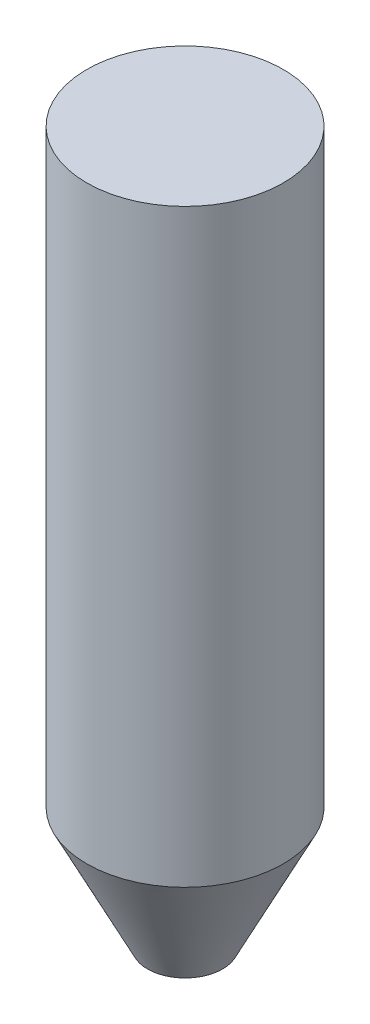
ISO-10303-21;
HEADER;
FILE_DESCRIPTION(('STEP AP214'),'2;1');
FILE_NAME('part.step','',(''),(''),'','','');
FILE_SCHEMA(('AUTOMOTIVE_DESIGN { 1 0 10303 214 1 1 1 1 }'));
ENDSEC;
DATA;
#1=APPLICATION_CONTEXT('core data for automotive mechanical design processes');
#2=APPLICATION_PROTOCOL_DEFINITION('international standard','automotive_design',2000,#1);
#3=PRODUCT_CONTEXT('',#1,'mechanical');
#4=PRODUCT('Part','Part','',(#3));
#5=PRODUCT_RELATED_PRODUCT_CATEGORY('part','',(#4));
#6=PRODUCT_DEFINITION_FORMATION('','',#4);
#7=PRODUCT_DEFINITION_CONTEXT('part definition',#1,'design');
#8=PRODUCT_DEFINITION('design','',#6,#7);
#9=PRODUCT_DEFINITION_SHAPE('','',#8);
#10=(LENGTH_UNIT() NAMED_UNIT(*) SI_UNIT(.MILLI.,.METRE.));
#11=(NAMED_UNIT(*) PLANE_ANGLE_UNIT() SI_UNIT($,.RADIAN.));
#12=(NAMED_UNIT(*) SI_UNIT($,.STERADIAN.) SOLID_ANGLE_UNIT());
#13=UNCERTAINTY_MEASURE_WITH_UNIT(LENGTH_MEASURE(1.E-05),#10,'distance_accuracy_value','');
#14=(GEOMETRIC_REPRESENTATION_CONTEXT(3) GLOBAL_UNCERTAINTY_ASSIGNED_CONTEXT((#13)) GLOBAL_UNIT_ASSIGNED_CONTEXT((#10,
#11,#12)) REPRESENTATION_CONTEXT('',''));
#15=CARTESIAN_POINT('',(0.,0.,0.));
#16=DIRECTION('',(0.,0.,1.));
#17=DIRECTION('',(1.,0.,0.));
#18=AXIS2_PLACEMENT_3D('',#15,#16,#17);
#19=CARTESIAN_POINT('',(0.,-12.0341960131261,0.));
#20=DIRECTION('',(0.,1.,0.));
#21=DIRECTION('',(0.,0.,1.));
#22=AXIS2_PLACEMENT_3D('',#19,#20,#21);
#23=CONICAL_SURFACE('',#22,0.,0.463647609000806);
#24=CARTESIAN_POINT('',(0.,26.0658039868739,0.));
#25=DIRECTION('',(0.,1.,0.));
#26=DIRECTION('',(0.,0.,1.));
#27=AXIS2_PLACEMENT_3D('',#24,#25,#26);
#28=CIRCLE('',#27,19.05);
#29=CARTESIAN_POINT('',(0.,26.0658039868739,19.05));
#30=VERTEX_POINT('',#29);
#31=EDGE_CURVE('E46',#30,#30,#28,.T.);
#32=ORIENTED_EDGE('',*,*,#31,.F.);
#33=EDGE_LOOP('',(#32));
#34=FACE_BOUND('',#33,.T.);
#35=CARTESIAN_POINT('',(0.,2.52338782459516,0.));
#36=DIRECTION('',(0.,1.,0.));
#37=DIRECTION('',(0.,0.,1.));
#38=AXIS2_PLACEMENT_3D('',#35,#36,#37);
#39=CIRCLE('',#38,7.27879191886063);
#40=CARTESIAN_POINT('',(0.,2.52338782459516,7.27879191886063));
#41=VERTEX_POINT('',#40);
#42=EDGE_CURVE('E10',#41,#41,#39,.T.);
#43=ORIENTED_EDGE('',*,*,#42,.T.);
#44=EDGE_LOOP('',(#43));
#45=FACE_BOUND('',#44,.T.);
#46=ADVANCED_FACE('F39',(#34,#45),#23,.T.);
#47=CARTESIAN_POINT('',(0.,140.365803986874,0.));
#48=DIRECTION('',(0.,-1.,0.));
#49=DIRECTION('',(0.,0.,-1.));
#50=AXIS2_PLACEMENT_3D('',#47,#48,#49);
#51=CYLINDRICAL_SURFACE('',#50,19.05);
#52=CARTESIAN_POINT('',(0.,140.365803986874,0.));
#53=DIRECTION('',(0.,1.,0.));
#54=DIRECTION('',(0.,0.,1.));
#55=AXIS2_PLACEMENT_3D('',#52,#53,#54);
#56=CIRCLE('',#55,19.05);
#57=CARTESIAN_POINT('',(0.,140.365803986874,19.05));
#58=VERTEX_POINT('',#57);
#59=EDGE_CURVE('E51',#58,#58,#56,.T.);
#60=ORIENTED_EDGE('',*,*,#59,.F.);
#61=EDGE_LOOP('',(#60));
#62=FACE_BOUND('',#61,.T.);
#63=ORIENTED_EDGE('',*,*,#31,.T.);
#64=EDGE_LOOP('',(#63));
#65=FACE_BOUND('',#64,.T.);
#66=ADVANCED_FACE('F61',(#62,#65),#51,.T.);
#67=CARTESIAN_POINT('',(0.,140.365803986874,0.));
#68=DIRECTION('',(0.,1.,0.));
#69=DIRECTION('',(0.,0.,1.));
#70=AXIS2_PLACEMENT_3D('',#67,#68,#69);
#71=PLANE('',#70);
#72=ORIENTED_EDGE('',*,*,#59,.T.);
#73=EDGE_LOOP('',(#72));
#74=FACE_BOUND('',#73,.T.);
#75=ADVANCED_FACE('F59',(#74),#71,.T.);
#76=CARTESIAN_POINT('',(-7.27879191886063,2.52338782459516,-19.05));
#77=DIRECTION('',(0.,1.,0.));
#78=DIRECTION('',(0.,0.,1.));
#79=AXIS2_PLACEMENT_3D('',#76,#77,#78);
#80=PLANE('',#79);
#81=ORIENTED_EDGE('',*,*,#42,.F.);
#82=EDGE_LOOP('',(#81));
#83=FACE_BOUND('',#82,.T.);
#84=ADVANCED_FACE('F67',(#83),#80,.F.);
#85=CLOSED_SHELL('',(#46,#66,#75,#84));
#86=MANIFOLD_SOLID_BREP('B2',#85);
#87=ADVANCED_BREP_SHAPE_REPRESENTATION('',(#18,#86),#14);
#88=SHAPE_DEFINITION_REPRESENTATION(#9,#87);
ENDSEC;
END-ISO-10303-21;
